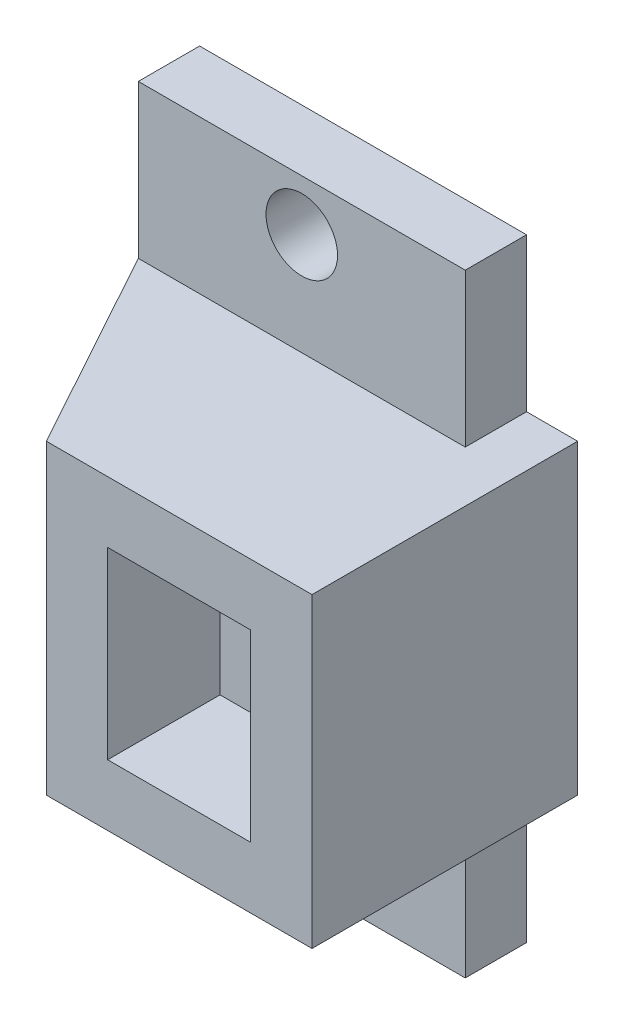
ISO-10303-21;
HEADER;
FILE_DESCRIPTION(('STEP AP214'),'2;1');
FILE_NAME('part.step','',(''),(''),'','','');
FILE_SCHEMA(('AUTOMOTIVE_DESIGN { 1 0 10303 214 1 1 1 1 }'));
ENDSEC;
DATA;
#1=APPLICATION_CONTEXT('core data for automotive mechanical design processes');
#2=APPLICATION_PROTOCOL_DEFINITION('international standard','automotive_design',2000,#1);
#3=PRODUCT_CONTEXT('',#1,'mechanical');
#4=PRODUCT('Part','Part','',(#3));
#5=PRODUCT_RELATED_PRODUCT_CATEGORY('part','',(#4));
#6=PRODUCT_DEFINITION_FORMATION('','',#4);
#7=PRODUCT_DEFINITION_CONTEXT('part definition',#1,'design');
#8=PRODUCT_DEFINITION('design','',#6,#7);
#9=PRODUCT_DEFINITION_SHAPE('','',#8);
#10=(LENGTH_UNIT() NAMED_UNIT(*) SI_UNIT(.MILLI.,.METRE.));
#11=(NAMED_UNIT(*) PLANE_ANGLE_UNIT() SI_UNIT($,.RADIAN.));
#12=(NAMED_UNIT(*) SI_UNIT($,.STERADIAN.) SOLID_ANGLE_UNIT());
#13=UNCERTAINTY_MEASURE_WITH_UNIT(LENGTH_MEASURE(1.E-05),#10,'distance_accuracy_value','');
#14=(GEOMETRIC_REPRESENTATION_CONTEXT(3) GLOBAL_UNCERTAINTY_ASSIGNED_CONTEXT((#13)) GLOBAL_UNIT_ASSIGNED_CONTEXT((#10,
#11,#12)) REPRESENTATION_CONTEXT('',''));
#15=CARTESIAN_POINT('',(0.,0.,0.));
#16=DIRECTION('',(0.,0.,1.));
#17=DIRECTION('',(1.,0.,0.));
#18=AXIS2_PLACEMENT_3D('',#15,#16,#17);
#19=CARTESIAN_POINT('',(0.,0.,3.));
#20=DIRECTION('',(0.,0.,1.));
#21=DIRECTION('',(1.,0.,0.));
#22=AXIS2_PLACEMENT_3D('',#19,#20,#21);
#23=PLANE('',#22);
#24=CARTESIAN_POINT('',(-9.25,0.,3.));
#25=DIRECTION('',(0.,0.,1.));
#26=DIRECTION('',(1.,0.,0.));
#27=AXIS2_PLACEMENT_3D('',#24,#25,#26);
#28=CIRCLE('',#27,1.75);
#29=CARTESIAN_POINT('',(-7.5,0.,3.));
#30=VERTEX_POINT('',#29);
#31=EDGE_CURVE('E288',#30,#30,#28,.T.);
#32=ORIENTED_EDGE('',*,*,#31,.F.);
#33=EDGE_LOOP('',(#32));
#34=FACE_BOUND('',#33,.T.);
#35=DIRECTION('',(0.,-1.,0.));
#36=VECTOR('',#35,1.);
#37=CARTESIAN_POINT('',(-6.5,0.,3.));
#38=LINE('',#37,#36);
#39=CARTESIAN_POINT('',(-6.5,4.5,3.));
#40=VERTEX_POINT('',#39);
#41=CARTESIAN_POINT('',(-6.5,-4.5,3.));
#42=VERTEX_POINT('',#41);
#43=EDGE_CURVE('E320',#40,#42,#38,.T.);
#44=ORIENTED_EDGE('',*,*,#43,.F.);
#45=DIRECTION('',(-1.,0.,0.));
#46=VECTOR('',#45,1.);
#47=CARTESIAN_POINT('',(0.,4.5,3.));
#48=LINE('',#47,#46);
#49=CARTESIAN_POINT('',(-12.,4.5,3.));
#50=VERTEX_POINT('',#49);
#51=EDGE_CURVE('E206',#40,#50,#48,.T.);
#52=ORIENTED_EDGE('',*,*,#51,.T.);
#53=DIRECTION('',(0.,-1.,0.));
#54=VECTOR('',#53,1.);
#55=CARTESIAN_POINT('',(-12.,0.,3.));
#56=LINE('',#55,#54);
#57=CARTESIAN_POINT('',(-12.,-4.5,3.));
#58=VERTEX_POINT('',#57);
#59=EDGE_CURVE('E309',#50,#58,#56,.T.);
#60=ORIENTED_EDGE('',*,*,#59,.T.);
#61=DIRECTION('',(1.,0.,0.));
#62=VECTOR('',#61,1.);
#63=CARTESIAN_POINT('',(0.,-4.5,3.));
#64=LINE('',#63,#62);
#65=EDGE_CURVE('E225',#58,#42,#64,.T.);
#66=ORIENTED_EDGE('',*,*,#65,.T.);
#67=EDGE_LOOP('',(#44,#52,#60,#66));
#68=FACE_BOUND('',#67,.T.);
#69=ADVANCED_FACE('F45',(#34,#68),#23,.T.);
#70=CARTESIAN_POINT('',(-6.5,0.,13.));
#71=DIRECTION('',(1.,0.,0.));
#72=DIRECTION('',(0.,1.,0.));
#73=AXIS2_PLACEMENT_3D('',#70,#71,#72);
#74=PLANE('',#73);
#75=DIRECTION('',(0.,0.,1.));
#76=VECTOR('',#75,1.);
#77=CARTESIAN_POINT('',(-6.5,4.5,13.));
#78=LINE('',#77,#76);
#79=CARTESIAN_POINT('',(-6.5,4.5,13.));
#80=VERTEX_POINT('',#79);
#81=EDGE_CURVE('E199',#40,#80,#78,.T.);
#82=ORIENTED_EDGE('',*,*,#81,.F.);
#83=ORIENTED_EDGE('',*,*,#43,.T.);
#84=DIRECTION('',(0.,0.,-1.));
#85=VECTOR('',#84,1.);
#86=CARTESIAN_POINT('',(-6.5,-4.5,13.));
#87=LINE('',#86,#85);
#88=CARTESIAN_POINT('',(-6.5,-4.5,13.));
#89=VERTEX_POINT('',#88);
#90=EDGE_CURVE('E218',#89,#42,#87,.T.);
#91=ORIENTED_EDGE('',*,*,#90,.F.);
#92=DIRECTION('',(0.,-1.,0.));
#93=VECTOR('',#92,1.);
#94=CARTESIAN_POINT('',(-6.5,0.,13.));
#95=LINE('',#94,#93);
#96=EDGE_CURVE('E245',#80,#89,#95,.T.);
#97=ORIENTED_EDGE('',*,*,#96,.F.);
#98=EDGE_LOOP('',(#82,#83,#91,#97));
#99=FACE_BOUND('',#98,.T.);
#100=ADVANCED_FACE('F427',(#99),#74,.F.);
#101=CARTESIAN_POINT('',(-12.,15.,3.));
#102=VERTEX_POINT('',#101);
#103=CARTESIAN_POINT('',(-12.,7.5,3.));
#104=VERTEX_POINT('',#103);
#105=EDGE_CURVE('E304',#102,#104,#56,.T.);
#106=ORIENTED_EDGE('',*,*,#105,.T.);
#107=DIRECTION('',(1.,0.,0.));
#108=VECTOR('',#107,1.);
#109=CARTESIAN_POINT('',(0.,7.5,3.));
#110=LINE('',#109,#108);
#111=CARTESIAN_POINT('',(4.,7.5,3.));
#112=VERTEX_POINT('',#111);
#113=EDGE_CURVE('E292',#104,#112,#110,.T.);
#114=ORIENTED_EDGE('',*,*,#113,.T.);
#115=DIRECTION('',(0.,1.,0.));
#116=VECTOR('',#115,1.);
#117=CARTESIAN_POINT('',(4.,0.,3.));
#118=LINE('',#117,#116);
#119=CARTESIAN_POINT('',(4.,15.,3.));
#120=VERTEX_POINT('',#119);
#121=EDGE_CURVE('E297',#112,#120,#118,.T.);
#122=ORIENTED_EDGE('',*,*,#121,.T.);
#123=DIRECTION('',(-1.,0.,0.));
#124=VECTOR('',#123,1.);
#125=CARTESIAN_POINT('',(0.,15.,3.));
#126=LINE('',#125,#124);
#127=EDGE_CURVE('E300',#120,#102,#126,.T.);
#128=ORIENTED_EDGE('',*,*,#127,.T.);
#129=EDGE_LOOP('',(#106,#114,#122,#128));
#130=FACE_BOUND('',#129,.T.);
#131=CARTESIAN_POINT('',(-4.,12.5,3.));
#132=DIRECTION('',(0.,0.,1.));
#133=DIRECTION('',(1.,0.,0.));
#134=AXIS2_PLACEMENT_3D('',#131,#132,#133);
#135=CIRCLE('',#134,1.75);
#136=CARTESIAN_POINT('',(-2.25,12.5,3.));
#137=VERTEX_POINT('',#136);
#138=EDGE_CURVE('E327',#137,#137,#135,.F.);
#139=ORIENTED_EDGE('',*,*,#138,.T.);
#140=EDGE_LOOP('',(#139));
#141=FACE_BOUND('',#140,.T.);
#142=ADVANCED_FACE('F434',(#130,#141),#23,.T.);
#143=CARTESIAN_POINT('',(4.,0.,3.));
#144=DIRECTION('',(-1.,0.,0.));
#145=DIRECTION('',(0.,-1.,0.));
#146=AXIS2_PLACEMENT_3D('',#143,#144,#145);
#147=PLANE('',#146);
#148=DIRECTION('',(0.,1.,0.));
#149=VECTOR('',#148,1.);
#150=CARTESIAN_POINT('',(4.,0.,0.));
#151=LINE('',#150,#149);
#152=CARTESIAN_POINT('',(4.,7.5,0.));
#153=VERTEX_POINT('',#152);
#154=CARTESIAN_POINT('',(4.,15.,0.));
#155=VERTEX_POINT('',#154);
#156=EDGE_CURVE('E335',#153,#155,#151,.T.);
#157=ORIENTED_EDGE('',*,*,#156,.T.);
#158=DIRECTION('',(0.,0.,-1.));
#159=VECTOR('',#158,1.);
#160=CARTESIAN_POINT('',(4.,15.,3.));
#161=LINE('',#160,#159);
#162=EDGE_CURVE('E54',#120,#155,#161,.T.);
#163=ORIENTED_EDGE('',*,*,#162,.F.);
#164=ORIENTED_EDGE('',*,*,#121,.F.);
#165=DIRECTION('',(0.,0.,-1.));
#166=VECTOR('',#165,1.);
#167=CARTESIAN_POINT('',(4.,7.5,3.));
#168=LINE('',#167,#166);
#169=EDGE_CURVE('E11',#112,#153,#168,.T.);
#170=ORIENTED_EDGE('',*,*,#169,.T.);
#171=EDGE_LOOP('',(#157,#163,#164,#170));
#172=FACE_BOUND('',#171,.T.);
#173=ADVANCED_FACE('F436',(#172),#147,.F.);
#174=CARTESIAN_POINT('',(0.,15.,3.));
#175=DIRECTION('',(0.,-1.,0.));
#176=DIRECTION('',(0.,0.,-1.));
#177=AXIS2_PLACEMENT_3D('',#174,#175,#176);
#178=PLANE('',#177);
#179=DIRECTION('',(-1.,0.,0.));
#180=VECTOR('',#179,1.);
#181=CARTESIAN_POINT('',(0.,15.,0.));
#182=LINE('',#181,#180);
#183=CARTESIAN_POINT('',(-12.,15.,0.));
#184=VERTEX_POINT('',#183);
#185=EDGE_CURVE('E338',#155,#184,#182,.T.);
#186=ORIENTED_EDGE('',*,*,#185,.T.);
#187=DIRECTION('',(0.,0.,-1.));
#188=VECTOR('',#187,1.);
#189=CARTESIAN_POINT('',(-12.,15.,3.));
#190=LINE('',#189,#188);
#191=EDGE_CURVE('E369',#102,#184,#190,.T.);
#192=ORIENTED_EDGE('',*,*,#191,.F.);
#193=ORIENTED_EDGE('',*,*,#127,.F.);
#194=ORIENTED_EDGE('',*,*,#162,.T.);
#195=EDGE_LOOP('',(#186,#192,#193,#194));
#196=FACE_BOUND('',#195,.T.);
#197=ADVANCED_FACE('F378',(#196),#178,.F.);
#198=CARTESIAN_POINT('',(-12.,0.,3.));
#199=DIRECTION('',(1.,0.,0.));
#200=DIRECTION('',(0.,0.,-1.));
#201=AXIS2_PLACEMENT_3D('',#198,#199,#200);
#202=PLANE('',#201);
#203=DIRECTION('',(0.,-1.,0.));
#204=VECTOR('',#203,1.);
#205=CARTESIAN_POINT('',(-12.,0.,0.));
#206=LINE('',#205,#204);
#207=CARTESIAN_POINT('',(-12.,-15.,0.));
#208=VERTEX_POINT('',#207);
#209=EDGE_CURVE('E341',#184,#208,#206,.T.);
#210=ORIENTED_EDGE('',*,*,#209,.T.);
#211=DIRECTION('',(0.,0.,-1.));
#212=VECTOR('',#211,1.);
#213=CARTESIAN_POINT('',(-12.,-15.,3.));
#214=LINE('',#213,#212);
#215=CARTESIAN_POINT('',(-12.,-15.,3.));
#216=VERTEX_POINT('',#215);
#217=EDGE_CURVE('E365',#216,#208,#214,.T.);
#218=ORIENTED_EDGE('',*,*,#217,.F.);
#219=CARTESIAN_POINT('',(-12.,-7.5,3.));
#220=VERTEX_POINT('',#219);
#221=EDGE_CURVE('E303',#220,#216,#56,.T.);
#222=ORIENTED_EDGE('',*,*,#221,.F.);
#223=DIRECTION('',(0.,-1.,0.));
#224=VECTOR('',#223,1.);
#225=CARTESIAN_POINT('',(-12.,0.,3.));
#226=LINE('',#225,#224);
#227=EDGE_CURVE('E229',#58,#220,#226,.T.);
#228=ORIENTED_EDGE('',*,*,#227,.F.);
#229=ORIENTED_EDGE('',*,*,#59,.F.);
#230=DIRECTION('',(0.,1.,0.));
#231=VECTOR('',#230,1.);
#232=CARTESIAN_POINT('',(-12.,0.,3.));
#233=LINE('',#232,#231);
#234=EDGE_CURVE('E210',#104,#50,#233,.F.);
#235=ORIENTED_EDGE('',*,*,#234,.F.);
#236=ORIENTED_EDGE('',*,*,#105,.F.);
#237=ORIENTED_EDGE('',*,*,#191,.T.);
#238=EDGE_LOOP('',(#210,#218,#222,#228,#229,#235,#236,#237));
#239=FACE_BOUND('',#238,.T.);
#240=ADVANCED_FACE('F391',(#239),#202,.F.);
#241=CARTESIAN_POINT('',(0.,-15.,3.));
#242=DIRECTION('',(0.,-1.,0.));
#243=DIRECTION('',(0.,0.,-1.));
#244=AXIS2_PLACEMENT_3D('',#241,#242,#243);
#245=PLANE('',#244);
#246=DIRECTION('',(-1.,0.,0.));
#247=VECTOR('',#246,1.);
#248=CARTESIAN_POINT('',(0.,-15.,0.));
#249=LINE('',#248,#247);
#250=CARTESIAN_POINT('',(4.,-15.,0.));
#251=VERTEX_POINT('',#250);
#252=EDGE_CURVE('E344',#251,#208,#249,.T.);
#253=ORIENTED_EDGE('',*,*,#252,.F.);
#254=DIRECTION('',(0.,0.,-1.));
#255=VECTOR('',#254,1.);
#256=CARTESIAN_POINT('',(4.,-15.,3.));
#257=LINE('',#256,#255);
#258=CARTESIAN_POINT('',(4.,-15.,3.));
#259=VERTEX_POINT('',#258);
#260=EDGE_CURVE('E362',#259,#251,#257,.T.);
#261=ORIENTED_EDGE('',*,*,#260,.F.);
#262=DIRECTION('',(-1.,0.,0.));
#263=VECTOR('',#262,1.);
#264=CARTESIAN_POINT('',(0.,-15.,3.));
#265=LINE('',#264,#263);
#266=EDGE_CURVE('E308',#259,#216,#265,.T.);
#267=ORIENTED_EDGE('',*,*,#266,.T.);
#268=ORIENTED_EDGE('',*,*,#217,.T.);
#269=EDGE_LOOP('',(#253,#261,#267,#268));
#270=FACE_BOUND('',#269,.T.);
#271=ADVANCED_FACE('F395',(#270),#245,.T.);
#272=CARTESIAN_POINT('',(4.,0.,3.));
#273=DIRECTION('',(-1.,0.,0.));
#274=DIRECTION('',(0.,-1.,0.));
#275=AXIS2_PLACEMENT_3D('',#272,#273,#274);
#276=PLANE('',#275);
#277=DIRECTION('',(0.,1.,0.));
#278=VECTOR('',#277,1.);
#279=CARTESIAN_POINT('',(4.,0.,0.));
#280=LINE('',#279,#278);
#281=CARTESIAN_POINT('',(4.,-7.5,0.));
#282=VERTEX_POINT('',#281);
#283=EDGE_CURVE('E348',#251,#282,#280,.T.);
#284=ORIENTED_EDGE('',*,*,#283,.T.);
#285=DIRECTION('',(0.,0.,-1.));
#286=VECTOR('',#285,1.);
#287=CARTESIAN_POINT('',(4.,-7.5,3.));
#288=LINE('',#287,#286);
#289=CARTESIAN_POINT('',(4.,-7.5,3.));
#290=VERTEX_POINT('',#289);
#291=EDGE_CURVE('E331',#290,#282,#288,.T.);
#292=ORIENTED_EDGE('',*,*,#291,.F.);
#293=DIRECTION('',(0.,1.,0.));
#294=VECTOR('',#293,1.);
#295=CARTESIAN_POINT('',(4.,0.,3.));
#296=LINE('',#295,#294);
#297=EDGE_CURVE('E313',#259,#290,#296,.T.);
#298=ORIENTED_EDGE('',*,*,#297,.F.);
#299=ORIENTED_EDGE('',*,*,#260,.T.);
#300=EDGE_LOOP('',(#284,#292,#298,#299));
#301=FACE_BOUND('',#300,.T.);
#302=ADVANCED_FACE('F486',(#301),#276,.F.);
#303=CARTESIAN_POINT('',(-4.,-12.5,3.));
#304=DIRECTION('',(0.,0.,-1.));
#305=DIRECTION('',(-1.,0.,0.));
#306=AXIS2_PLACEMENT_3D('',#303,#304,#305);
#307=CYLINDRICAL_SURFACE('',#306,1.75);
#308=CARTESIAN_POINT('',(-4.,-12.5,3.));
#309=DIRECTION('',(0.,0.,1.));
#310=DIRECTION('',(1.,0.,0.));
#311=AXIS2_PLACEMENT_3D('',#308,#309,#310);
#312=CIRCLE('',#311,1.75);
#313=CARTESIAN_POINT('',(-2.25,-12.5,3.));
#314=VERTEX_POINT('',#313);
#315=EDGE_CURVE('E323',#314,#314,#312,.T.);
#316=ORIENTED_EDGE('',*,*,#315,.T.);
#317=EDGE_LOOP('',(#316));
#318=FACE_BOUND('',#317,.T.);
#319=CARTESIAN_POINT('',(-4.,-12.5,0.));
#320=DIRECTION('',(0.,0.,1.));
#321=DIRECTION('',(1.,0.,0.));
#322=AXIS2_PLACEMENT_3D('',#319,#320,#321);
#323=CIRCLE('',#322,1.75);
#324=CARTESIAN_POINT('',(-2.25,-12.5,0.));
#325=VERTEX_POINT('',#324);
#326=EDGE_CURVE('E352',#325,#325,#323,.T.);
#327=ORIENTED_EDGE('',*,*,#326,.F.);
#328=EDGE_LOOP('',(#327));
#329=FACE_BOUND('',#328,.T.);
#330=ADVANCED_FACE('F479',(#318,#329),#307,.F.);
#331=CARTESIAN_POINT('',(-9.25,0.,3.));
#332=DIRECTION('',(0.,0.,-1.));
#333=DIRECTION('',(-1.,0.,0.));
#334=AXIS2_PLACEMENT_3D('',#331,#332,#333);
#335=CYLINDRICAL_SURFACE('',#334,1.75);
#336=ORIENTED_EDGE('',*,*,#31,.T.);
#337=EDGE_LOOP('',(#336));
#338=FACE_BOUND('',#337,.T.);
#339=CARTESIAN_POINT('',(-9.25,0.,0.));
#340=DIRECTION('',(0.,0.,1.));
#341=DIRECTION('',(1.,0.,0.));
#342=AXIS2_PLACEMENT_3D('',#339,#340,#341);
#343=CIRCLE('',#342,1.75);
#344=CARTESIAN_POINT('',(-7.5,0.,0.));
#345=VERTEX_POINT('',#344);
#346=EDGE_CURVE('E281',#345,#345,#343,.T.);
#347=ORIENTED_EDGE('',*,*,#346,.F.);
#348=EDGE_LOOP('',(#347));
#349=FACE_BOUND('',#348,.T.);
#350=ADVANCED_FACE('F47',(#338,#349),#335,.F.);
#351=CARTESIAN_POINT('',(-4.,12.5,3.));
#352=DIRECTION('',(0.,0.,-1.));
#353=DIRECTION('',(-1.,0.,0.));
#354=AXIS2_PLACEMENT_3D('',#351,#352,#353);
#355=CYLINDRICAL_SURFACE('',#354,1.75);
#356=ORIENTED_EDGE('',*,*,#138,.F.);
#357=EDGE_LOOP('',(#356));
#358=FACE_BOUND('',#357,.T.);
#359=CARTESIAN_POINT('',(-4.,12.5,0.));
#360=DIRECTION('',(0.,0.,1.));
#361=DIRECTION('',(1.,0.,0.));
#362=AXIS2_PLACEMENT_3D('',#359,#360,#361);
#363=CIRCLE('',#362,1.75);
#364=CARTESIAN_POINT('',(-2.25,12.5,0.));
#365=VERTEX_POINT('',#364);
#366=EDGE_CURVE('E293',#365,#365,#363,.F.);
#367=ORIENTED_EDGE('',*,*,#366,.T.);
#368=EDGE_LOOP('',(#367));
#369=FACE_BOUND('',#368,.T.);
#370=ADVANCED_FACE('F469',(#358,#369),#355,.F.);
#371=DIRECTION('',(1.,0.,0.));
#372=VECTOR('',#371,1.);
#373=CARTESIAN_POINT('',(0.,-7.5,3.));
#374=LINE('',#373,#372);
#375=EDGE_CURVE('E317',#220,#290,#374,.T.);
#376=ORIENTED_EDGE('',*,*,#375,.F.);
#377=ORIENTED_EDGE('',*,*,#221,.T.);
#378=ORIENTED_EDGE('',*,*,#266,.F.);
#379=ORIENTED_EDGE('',*,*,#297,.T.);
#380=EDGE_LOOP('',(#376,#377,#378,#379));
#381=FACE_BOUND('',#380,.T.);
#382=ORIENTED_EDGE('',*,*,#315,.F.);
#383=EDGE_LOOP('',(#382));
#384=FACE_BOUND('',#383,.T.);
#385=ADVANCED_FACE('F399',(#381,#384),#23,.T.);
#386=CARTESIAN_POINT('',(0.,0.,0.));
#387=DIRECTION('',(0.,0.,1.));
#388=DIRECTION('',(1.,0.,0.));
#389=AXIS2_PLACEMENT_3D('',#386,#387,#388);
#390=PLANE('',#389);
#391=ORIENTED_EDGE('',*,*,#156,.F.);
#392=DIRECTION('',(1.,0.,0.));
#393=VECTOR('',#392,1.);
#394=CARTESIAN_POINT('',(0.,7.5,0.));
#395=LINE('',#394,#393);
#396=CARTESIAN_POINT('',(6.5,7.5,0.));
#397=VERTEX_POINT('',#396);
#398=EDGE_CURVE('E233',#153,#397,#395,.T.);
#399=ORIENTED_EDGE('',*,*,#398,.T.);
#400=DIRECTION('',(0.,-1.,0.));
#401=VECTOR('',#400,1.);
#402=CARTESIAN_POINT('',(6.5,0.,0.));
#403=LINE('',#402,#401);
#404=CARTESIAN_POINT('',(6.5,-7.5,0.));
#405=VERTEX_POINT('',#404);
#406=EDGE_CURVE('E239',#397,#405,#403,.T.);
#407=ORIENTED_EDGE('',*,*,#406,.T.);
#408=DIRECTION('',(1.,0.,0.));
#409=VECTOR('',#408,1.);
#410=CARTESIAN_POINT('',(0.,-7.5,0.));
#411=LINE('',#410,#409);
#412=EDGE_CURVE('E267',#282,#405,#411,.T.);
#413=ORIENTED_EDGE('',*,*,#412,.F.);
#414=ORIENTED_EDGE('',*,*,#283,.F.);
#415=ORIENTED_EDGE('',*,*,#252,.T.);
#416=ORIENTED_EDGE('',*,*,#209,.F.);
#417=ORIENTED_EDGE('',*,*,#185,.F.);
#418=EDGE_LOOP('',(#391,#399,#407,#413,#414,#415,#416,#417));
#419=FACE_BOUND('',#418,.T.);
#420=ORIENTED_EDGE('',*,*,#366,.F.);
#421=EDGE_LOOP('',(#420));
#422=FACE_BOUND('',#421,.T.);
#423=ORIENTED_EDGE('',*,*,#346,.T.);
#424=EDGE_LOOP('',(#423));
#425=FACE_BOUND('',#424,.T.);
#426=ORIENTED_EDGE('',*,*,#326,.T.);
#427=EDGE_LOOP('',(#426));
#428=FACE_BOUND('',#427,.T.);
#429=ADVANCED_FACE('F385',(#419,#422,#425,#428),#390,.F.);
#430=CARTESIAN_POINT('',(0.,7.5,13.));
#431=DIRECTION('',(0.,1.,0.));
#432=DIRECTION('',(0.,0.,1.));
#433=AXIS2_PLACEMENT_3D('',#430,#431,#432);
#434=PLANE('',#433);
#435=ORIENTED_EDGE('',*,*,#169,.F.);
#436=ORIENTED_EDGE('',*,*,#113,.F.);
#437=DIRECTION('',(-0.481918749772156,0.,-0.876215908676647));
#438=VECTOR('',#437,1.);
#439=CARTESIAN_POINT('',(-6.5,7.5,13.));
#440=LINE('',#439,#438);
#441=CARTESIAN_POINT('',(-6.5,7.5,13.));
#442=VERTEX_POINT('',#441);
#443=EDGE_CURVE('E195',#442,#104,#440,.T.);
#444=ORIENTED_EDGE('',*,*,#443,.F.);
#445=DIRECTION('',(1.,0.,0.));
#446=VECTOR('',#445,1.);
#447=CARTESIAN_POINT('',(0.,7.5,13.));
#448=LINE('',#447,#446);
#449=CARTESIAN_POINT('',(6.5,7.5,13.));
#450=VERTEX_POINT('',#449);
#451=EDGE_CURVE('E234',#442,#450,#448,.T.);
#452=ORIENTED_EDGE('',*,*,#451,.T.);
#453=DIRECTION('',(0.,0.,-1.));
#454=VECTOR('',#453,1.);
#455=CARTESIAN_POINT('',(6.5,7.5,13.));
#456=LINE('',#455,#454);
#457=EDGE_CURVE('E264',#450,#397,#456,.T.);
#458=ORIENTED_EDGE('',*,*,#457,.T.);
#459=ORIENTED_EDGE('',*,*,#398,.F.);
#460=EDGE_LOOP('',(#435,#436,#444,#452,#458,#459));
#461=FACE_BOUND('',#460,.T.);
#462=ADVANCED_FACE('F438',(#461),#434,.T.);
#463=CARTESIAN_POINT('',(0.,-7.5,13.));
#464=DIRECTION('',(0.,1.,0.));
#465=DIRECTION('',(0.,0.,1.));
#466=AXIS2_PLACEMENT_3D('',#463,#464,#465);
#467=PLANE('',#466);
#468=ORIENTED_EDGE('',*,*,#375,.T.);
#469=ORIENTED_EDGE('',*,*,#291,.T.);
#470=ORIENTED_EDGE('',*,*,#412,.T.);
#471=DIRECTION('',(0.,0.,-1.));
#472=VECTOR('',#471,1.);
#473=CARTESIAN_POINT('',(6.5,-7.5,13.));
#474=LINE('',#473,#472);
#475=CARTESIAN_POINT('',(6.5,-7.5,13.));
#476=VERTEX_POINT('',#475);
#477=EDGE_CURVE('E274',#476,#405,#474,.T.);
#478=ORIENTED_EDGE('',*,*,#477,.F.);
#479=DIRECTION('',(1.,0.,0.));
#480=VECTOR('',#479,1.);
#481=CARTESIAN_POINT('',(0.,-7.5,13.));
#482=LINE('',#481,#480);
#483=CARTESIAN_POINT('',(-6.5,-7.5,13.));
#484=VERTEX_POINT('',#483);
#485=EDGE_CURVE('E244',#484,#476,#482,.T.);
#486=ORIENTED_EDGE('',*,*,#485,.F.);
#487=DIRECTION('',(-0.481918749772156,0.,-0.876215908676647));
#488=VECTOR('',#487,1.);
#489=CARTESIAN_POINT('',(-6.5,-7.5,13.));
#490=LINE('',#489,#488);
#491=EDGE_CURVE('E214',#484,#220,#490,.T.);
#492=ORIENTED_EDGE('',*,*,#491,.T.);
#493=EDGE_LOOP('',(#468,#469,#470,#478,#486,#492));
#494=FACE_BOUND('',#493,.T.);
#495=ADVANCED_FACE('F443',(#494),#467,.F.);
#496=CARTESIAN_POINT('',(0.,4.5,13.));
#497=DIRECTION('',(0.,1.,0.));
#498=DIRECTION('',(0.,0.,1.));
#499=AXIS2_PLACEMENT_3D('',#496,#497,#498);
#500=PLANE('',#499);
#501=DIRECTION('',(0.,0.,-1.));
#502=VECTOR('',#501,1.);
#503=CARTESIAN_POINT('',(-3.5,4.5,13.));
#504=LINE('',#503,#502);
#505=CARTESIAN_POINT('',(-3.5,4.5,13.));
#506=VERTEX_POINT('',#505);
#507=CARTESIAN_POINT('',(-3.5,4.5,7.5));
#508=VERTEX_POINT('',#507);
#509=EDGE_CURVE('E179',#506,#508,#504,.T.);
#510=ORIENTED_EDGE('',*,*,#509,.T.);
#511=DIRECTION('',(1.,0.,0.));
#512=VECTOR('',#511,1.);
#513=CARTESIAN_POINT('',(0.,4.5,7.5));
#514=LINE('',#513,#512);
#515=CARTESIAN_POINT('',(3.5,4.5,7.5));
#516=VERTEX_POINT('',#515);
#517=EDGE_CURVE('E61',#508,#516,#514,.T.);
#518=ORIENTED_EDGE('',*,*,#517,.T.);
#519=DIRECTION('',(0.,0.,-1.));
#520=VECTOR('',#519,1.);
#521=CARTESIAN_POINT('',(3.5,4.5,13.));
#522=LINE('',#521,#520);
#523=CARTESIAN_POINT('',(3.5,4.5,13.));
#524=VERTEX_POINT('',#523);
#525=EDGE_CURVE('E278',#524,#516,#522,.T.);
#526=ORIENTED_EDGE('',*,*,#525,.F.);
#527=DIRECTION('',(1.,0.,0.));
#528=VECTOR('',#527,1.);
#529=CARTESIAN_POINT('',(0.,4.5,13.));
#530=LINE('',#529,#528);
#531=EDGE_CURVE('E252',#506,#524,#530,.T.);
#532=ORIENTED_EDGE('',*,*,#531,.F.);
#533=EDGE_LOOP('',(#510,#518,#526,#532));
#534=FACE_BOUND('',#533,.T.);
#535=ADVANCED_FACE('F588',(#534),#500,.F.);
#536=CARTESIAN_POINT('',(3.5,0.,13.));
#537=DIRECTION('',(1.,0.,0.));
#538=DIRECTION('',(0.,1.,0.));
#539=AXIS2_PLACEMENT_3D('',#536,#537,#538);
#540=PLANE('',#539);
#541=ORIENTED_EDGE('',*,*,#525,.T.);
#542=DIRECTION('',(0.,-1.,0.));
#543=VECTOR('',#542,1.);
#544=CARTESIAN_POINT('',(3.5,0.,7.5));
#545=LINE('',#544,#543);
#546=CARTESIAN_POINT('',(3.5,-4.5,7.5));
#547=VERTEX_POINT('',#546);
#548=EDGE_CURVE('E68',#516,#547,#545,.T.);
#549=ORIENTED_EDGE('',*,*,#548,.T.);
#550=DIRECTION('',(0.,0.,-1.));
#551=VECTOR('',#550,1.);
#552=CARTESIAN_POINT('',(3.5,-4.5,13.));
#553=LINE('',#552,#551);
#554=CARTESIAN_POINT('',(3.5,-4.5,13.));
#555=VERTEX_POINT('',#554);
#556=EDGE_CURVE('E178',#555,#547,#553,.T.);
#557=ORIENTED_EDGE('',*,*,#556,.F.);
#558=DIRECTION('',(0.,-1.,0.));
#559=VECTOR('',#558,1.);
#560=CARTESIAN_POINT('',(3.5,0.,13.));
#561=LINE('',#560,#559);
#562=EDGE_CURVE('E256',#524,#555,#561,.T.);
#563=ORIENTED_EDGE('',*,*,#562,.F.);
#564=EDGE_LOOP('',(#541,#549,#557,#563));
#565=FACE_BOUND('',#564,.T.);
#566=ADVANCED_FACE('F453',(#565),#540,.F.);
#567=CARTESIAN_POINT('',(0.,-4.5,13.));
#568=DIRECTION('',(0.,1.,0.));
#569=DIRECTION('',(-1.,0.,0.));
#570=AXIS2_PLACEMENT_3D('',#567,#568,#569);
#571=PLANE('',#570);
#572=DIRECTION('',(1.,0.,0.));
#573=VECTOR('',#572,1.);
#574=CARTESIAN_POINT('',(0.,-4.5,7.5));
#575=LINE('',#574,#573);
#576=CARTESIAN_POINT('',(-3.5,-4.5,7.5));
#577=VERTEX_POINT('',#576);
#578=EDGE_CURVE('E182',#577,#547,#575,.T.);
#579=ORIENTED_EDGE('',*,*,#578,.F.);
#580=DIRECTION('',(0.,0.,-1.));
#581=VECTOR('',#580,1.);
#582=CARTESIAN_POINT('',(-3.5,-4.5,13.));
#583=LINE('',#582,#581);
#584=CARTESIAN_POINT('',(-3.5,-4.5,13.));
#585=VERTEX_POINT('',#584);
#586=EDGE_CURVE('E167',#585,#577,#583,.T.);
#587=ORIENTED_EDGE('',*,*,#586,.F.);
#588=DIRECTION('',(1.,0.,0.));
#589=VECTOR('',#588,1.);
#590=CARTESIAN_POINT('',(0.,-4.5,13.));
#591=LINE('',#590,#589);
#592=EDGE_CURVE('E259',#585,#555,#591,.T.);
#593=ORIENTED_EDGE('',*,*,#592,.T.);
#594=ORIENTED_EDGE('',*,*,#556,.T.);
#595=EDGE_LOOP('',(#579,#587,#593,#594));
#596=FACE_BOUND('',#595,.T.);
#597=ADVANCED_FACE('F183',(#596),#571,.T.);
#598=CARTESIAN_POINT('',(6.5,0.,13.));
#599=DIRECTION('',(1.,0.,0.));
#600=DIRECTION('',(0.,1.,0.));
#601=AXIS2_PLACEMENT_3D('',#598,#599,#600);
#602=PLANE('',#601);
#603=DIRECTION('',(0.,-1.,0.));
#604=VECTOR('',#603,1.);
#605=CARTESIAN_POINT('',(6.5,0.,13.));
#606=LINE('',#605,#604);
#607=EDGE_CURVE('E249',#450,#476,#606,.T.);
#608=ORIENTED_EDGE('',*,*,#607,.T.);
#609=ORIENTED_EDGE('',*,*,#477,.T.);
#610=ORIENTED_EDGE('',*,*,#406,.F.);
#611=ORIENTED_EDGE('',*,*,#457,.F.);
#612=EDGE_LOOP('',(#608,#609,#610,#611));
#613=FACE_BOUND('',#612,.T.);
#614=ADVANCED_FACE('F444',(#613),#602,.T.);
#615=CARTESIAN_POINT('',(-3.5,0.,13.));
#616=DIRECTION('',(1.,0.,0.));
#617=DIRECTION('',(0.,1.,0.));
#618=AXIS2_PLACEMENT_3D('',#615,#616,#617);
#619=PLANE('',#618);
#620=DIRECTION('',(0.,-1.,0.));
#621=VECTOR('',#620,1.);
#622=CARTESIAN_POINT('',(-3.5,0.,7.5));
#623=LINE('',#622,#621);
#624=EDGE_CURVE('E171',#508,#577,#623,.T.);
#625=ORIENTED_EDGE('',*,*,#624,.F.);
#626=ORIENTED_EDGE('',*,*,#509,.F.);
#627=DIRECTION('',(0.,-1.,0.));
#628=VECTOR('',#627,1.);
#629=CARTESIAN_POINT('',(-3.5,0.,13.));
#630=LINE('',#629,#628);
#631=EDGE_CURVE('E173',#506,#585,#630,.T.);
#632=ORIENTED_EDGE('',*,*,#631,.T.);
#633=ORIENTED_EDGE('',*,*,#586,.T.);
#634=EDGE_LOOP('',(#625,#626,#632,#633));
#635=FACE_BOUND('',#634,.T.);
#636=ADVANCED_FACE('F169',(#635),#619,.T.);
#637=CARTESIAN_POINT('',(0.,0.,13.));
#638=DIRECTION('',(0.,0.,1.));
#639=DIRECTION('',(1.,0.,0.));
#640=AXIS2_PLACEMENT_3D('',#637,#638,#639);
#641=PLANE('',#640);
#642=ORIENTED_EDGE('',*,*,#531,.T.);
#643=ORIENTED_EDGE('',*,*,#562,.T.);
#644=ORIENTED_EDGE('',*,*,#592,.F.);
#645=ORIENTED_EDGE('',*,*,#631,.F.);
#646=EDGE_LOOP('',(#642,#643,#644,#645));
#647=FACE_BOUND('',#646,.T.);
#648=ORIENTED_EDGE('',*,*,#485,.T.);
#649=ORIENTED_EDGE('',*,*,#607,.F.);
#650=ORIENTED_EDGE('',*,*,#451,.F.);
#651=EDGE_CURVE('E240',#442,#80,#95,.T.);
#652=ORIENTED_EDGE('',*,*,#651,.T.);
#653=ORIENTED_EDGE('',*,*,#96,.T.);
#654=EDGE_CURVE('E238',#89,#484,#95,.T.);
#655=ORIENTED_EDGE('',*,*,#654,.T.);
#656=EDGE_LOOP('',(#648,#649,#650,#652,#653,#655));
#657=FACE_BOUND('',#656,.T.);
#658=ADVANCED_FACE('F423',(#647,#657),#641,.T.);
#659=CARTESIAN_POINT('',(-6.5,-7.5,13.));
#660=DIRECTION('',(-0.876215908676647,0.,0.481918749772156));
#661=DIRECTION('',(-0.481918749772156,0.,-0.876215908676647));
#662=AXIS2_PLACEMENT_3D('',#659,#660,#661);
#663=PLANE('',#662);
#664=DIRECTION('',(-0.481918749772156,0.,-0.876215908676647));
#665=VECTOR('',#664,1.);
#666=CARTESIAN_POINT('',(-6.5,-4.5,13.));
#667=LINE('',#666,#665);
#668=EDGE_CURVE('E213',#89,#58,#667,.T.);
#669=ORIENTED_EDGE('',*,*,#668,.T.);
#670=ORIENTED_EDGE('',*,*,#227,.T.);
#671=ORIENTED_EDGE('',*,*,#491,.F.);
#672=ORIENTED_EDGE('',*,*,#654,.F.);
#673=EDGE_LOOP('',(#669,#670,#671,#672));
#674=FACE_BOUND('',#673,.T.);
#675=ADVANCED_FACE('F416',(#674),#663,.T.);
#676=CARTESIAN_POINT('',(-2.75,-4.5,6.5));
#677=DIRECTION('',(0.,-1.,0.));
#678=DIRECTION('',(0.,0.,-1.));
#679=AXIS2_PLACEMENT_3D('',#676,#677,#678);
#680=PLANE('',#679);
#681=ORIENTED_EDGE('',*,*,#65,.F.);
#682=ORIENTED_EDGE('',*,*,#668,.F.);
#683=ORIENTED_EDGE('',*,*,#90,.T.);
#684=EDGE_LOOP('',(#681,#682,#683));
#685=FACE_BOUND('',#684,.T.);
#686=ADVANCED_FACE('F412',(#685),#680,.F.);
#687=CARTESIAN_POINT('',(-6.5,7.5,13.));
#688=DIRECTION('',(0.876215908676647,0.,-0.481918749772156));
#689=DIRECTION('',(-0.481918749772156,0.,-0.876215908676647));
#690=AXIS2_PLACEMENT_3D('',#687,#688,#689);
#691=PLANE('',#690);
#692=ORIENTED_EDGE('',*,*,#443,.T.);
#693=ORIENTED_EDGE('',*,*,#234,.T.);
#694=DIRECTION('',(-0.481918749772156,0.,-0.876215908676647));
#695=VECTOR('',#694,1.);
#696=CARTESIAN_POINT('',(-6.5,4.5,13.));
#697=LINE('',#696,#695);
#698=EDGE_CURVE('E186',#80,#50,#697,.T.);
#699=ORIENTED_EDGE('',*,*,#698,.F.);
#700=ORIENTED_EDGE('',*,*,#651,.F.);
#701=EDGE_LOOP('',(#692,#693,#699,#700));
#702=FACE_BOUND('',#701,.T.);
#703=ADVANCED_FACE('F431',(#702),#691,.F.);
#704=CARTESIAN_POINT('',(-2.75,4.5,6.5));
#705=DIRECTION('',(0.,1.,0.));
#706=DIRECTION('',(0.,0.,1.));
#707=AXIS2_PLACEMENT_3D('',#704,#705,#706);
#708=PLANE('',#707);
#709=ORIENTED_EDGE('',*,*,#51,.F.);
#710=ORIENTED_EDGE('',*,*,#81,.T.);
#711=ORIENTED_EDGE('',*,*,#698,.T.);
#712=EDGE_LOOP('',(#709,#710,#711));
#713=FACE_BOUND('',#712,.T.);
#714=ADVANCED_FACE('F429',(#713),#708,.F.);
#715=CARTESIAN_POINT('',(0.,0.,7.5));
#716=DIRECTION('',(0.,0.,1.));
#717=DIRECTION('',(1.,0.,0.));
#718=AXIS2_PLACEMENT_3D('',#715,#716,#717);
#719=PLANE('',#718);
#720=ORIENTED_EDGE('',*,*,#548,.F.);
#721=ORIENTED_EDGE('',*,*,#517,.F.);
#722=ORIENTED_EDGE('',*,*,#624,.T.);
#723=ORIENTED_EDGE('',*,*,#578,.T.);
#724=EDGE_LOOP('',(#720,#721,#722,#723));
#725=FACE_BOUND('',#724,.T.);
#726=ADVANCED_FACE('F188',(#725),#719,.T.);
#727=CLOSED_SHELL('',(#69,#100,#142,#173,#197,#240,#271,#302,#330,#350,#370,#385,#429,#462,#495,
#535,#566,#597,#614,#636,#658,#675,#686,#703,#714,#726));
#728=MANIFOLD_SOLID_BREP('B2',#727);
#729=ADVANCED_BREP_SHAPE_REPRESENTATION('',(#18,#728),#14);
#730=SHAPE_DEFINITION_REPRESENTATION(#9,#729);
ENDSEC;
END-ISO-10303-21;
